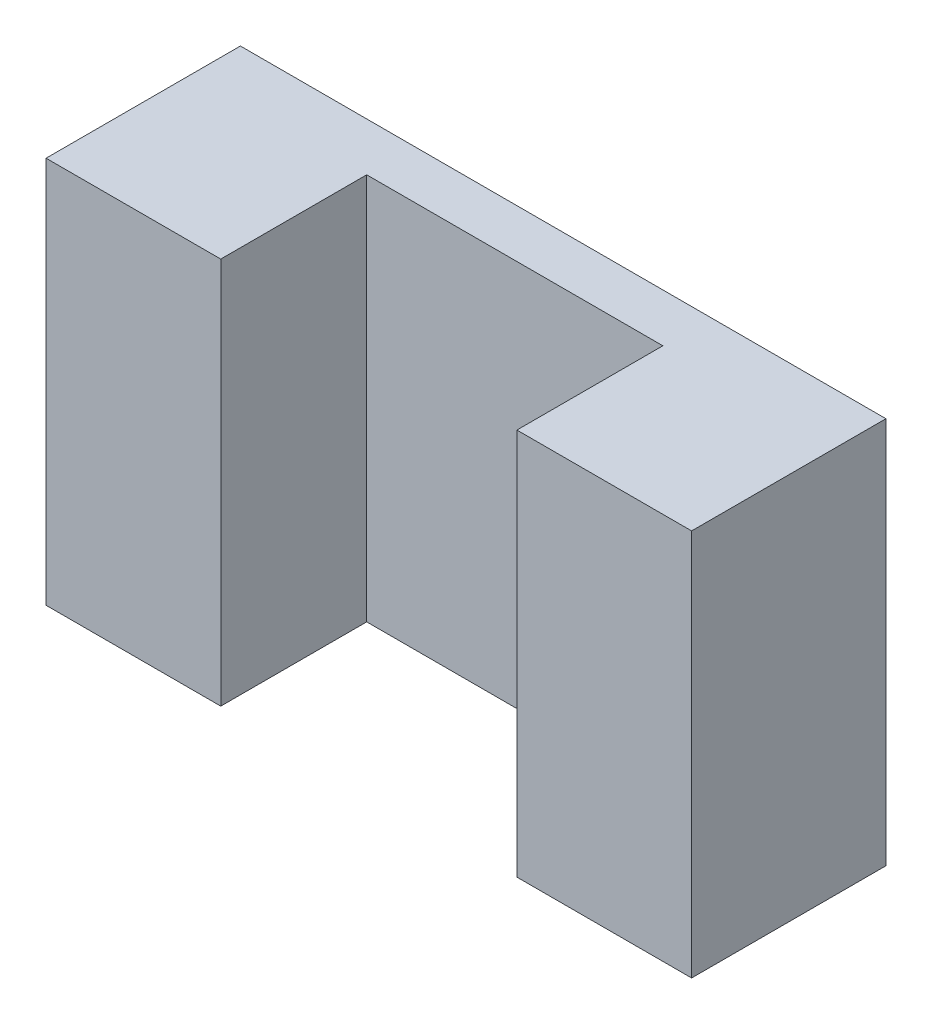
ISO-10303-21;
HEADER;
FILE_DESCRIPTION(('STEP AP214'),'2;1');
FILE_NAME('part.step','',(''),(''),'','','');
FILE_SCHEMA(('AUTOMOTIVE_DESIGN { 1 0 10303 214 1 1 1 1 }'));
ENDSEC;
DATA;
#1=APPLICATION_CONTEXT('core data for automotive mechanical design processes');
#2=APPLICATION_PROTOCOL_DEFINITION('international standard','automotive_design',2000,#1);
#3=PRODUCT_CONTEXT('',#1,'mechanical');
#4=PRODUCT('Part','Part','',(#3));
#5=PRODUCT_RELATED_PRODUCT_CATEGORY('part','',(#4));
#6=PRODUCT_DEFINITION_FORMATION('','',#4);
#7=PRODUCT_DEFINITION_CONTEXT('part definition',#1,'design');
#8=PRODUCT_DEFINITION('design','',#6,#7);
#9=PRODUCT_DEFINITION_SHAPE('','',#8);
#10=(LENGTH_UNIT() NAMED_UNIT(*) SI_UNIT(.MILLI.,.METRE.));
#11=(NAMED_UNIT(*) PLANE_ANGLE_UNIT() SI_UNIT($,.RADIAN.));
#12=(NAMED_UNIT(*) SI_UNIT($,.STERADIAN.) SOLID_ANGLE_UNIT());
#13=UNCERTAINTY_MEASURE_WITH_UNIT(LENGTH_MEASURE(1.E-05),#10,'distance_accuracy_value','');
#14=(GEOMETRIC_REPRESENTATION_CONTEXT(3) GLOBAL_UNCERTAINTY_ASSIGNED_CONTEXT((#13)) GLOBAL_UNIT_ASSIGNED_CONTEXT((#10,
#11,#12)) REPRESENTATION_CONTEXT('',''));
#15=CARTESIAN_POINT('',(0.,0.,0.));
#16=DIRECTION('',(0.,0.,1.));
#17=DIRECTION('',(1.,0.,0.));
#18=AXIS2_PLACEMENT_3D('',#15,#16,#17);
#19=CARTESIAN_POINT('',(0.,0.,20.));
#20=DIRECTION('',(0.,0.,-1.));
#21=DIRECTION('',(-1.,0.,0.));
#22=AXIS2_PLACEMENT_3D('',#19,#20,#21);
#23=PLANE('',#22);
#24=DIRECTION('',(1.,0.,0.));
#25=VECTOR('',#24,1.);
#26=CARTESIAN_POINT('',(33.218726945,-19.925,20.));
#27=LINE('',#26,#25);
#28=CARTESIAN_POINT('',(-33.218726945,-19.925,20.));
#29=VERTEX_POINT('',#28);
#30=CARTESIAN_POINT('',(-15.24,-19.925,20.));
#31=VERTEX_POINT('',#30);
#32=EDGE_CURVE('E85',#29,#31,#27,.T.);
#33=ORIENTED_EDGE('',*,*,#32,.T.);
#34=DIRECTION('',(0.,-1.,0.));
#35=VECTOR('',#34,1.);
#36=CARTESIAN_POINT('',(-15.24,19.925,20.));
#37=LINE('',#36,#35);
#38=CARTESIAN_POINT('',(-15.24,19.925,20.));
#39=VERTEX_POINT('',#38);
#40=EDGE_CURVE('E111',#39,#31,#37,.T.);
#41=ORIENTED_EDGE('',*,*,#40,.F.);
#42=DIRECTION('',(-1.,0.,0.));
#43=VECTOR('',#42,1.);
#44=CARTESIAN_POINT('',(33.218726945,19.925,20.));
#45=LINE('',#44,#43);
#46=CARTESIAN_POINT('',(-33.218726945,19.925,20.));
#47=VERTEX_POINT('',#46);
#48=EDGE_CURVE('E56',#39,#47,#45,.T.);
#49=ORIENTED_EDGE('',*,*,#48,.T.);
#50=DIRECTION('',(0.,-1.,0.));
#51=VECTOR('',#50,1.);
#52=CARTESIAN_POINT('',(-33.218726945,19.925,20.));
#53=LINE('',#52,#51);
#54=EDGE_CURVE('E140',#47,#29,#53,.T.);
#55=ORIENTED_EDGE('',*,*,#54,.T.);
#56=EDGE_LOOP('',(#33,#41,#49,#55));
#57=FACE_BOUND('',#56,.T.);
#58=ADVANCED_FACE('F32',(#57),#23,.F.);
#59=CARTESIAN_POINT('',(-33.218726945,19.925,20.));
#60=DIRECTION('',(1.,0.,0.));
#61=DIRECTION('',(0.,1.,0.));
#62=AXIS2_PLACEMENT_3D('',#59,#60,#61);
#63=PLANE('',#62);
#64=DIRECTION('',(0.,-1.,0.));
#65=VECTOR('',#64,1.);
#66=CARTESIAN_POINT('',(-33.218726945,19.925,0.));
#67=LINE('',#66,#65);
#68=CARTESIAN_POINT('',(-33.218726945,19.925,0.));
#69=VERTEX_POINT('',#68);
#70=CARTESIAN_POINT('',(-33.218726945,-19.925,0.));
#71=VERTEX_POINT('',#70);
#72=EDGE_CURVE('E135',#69,#71,#67,.T.);
#73=ORIENTED_EDGE('',*,*,#72,.T.);
#74=DIRECTION('',(0.,0.,-1.));
#75=VECTOR('',#74,1.);
#76=CARTESIAN_POINT('',(-33.218726945,-19.925,20.));
#77=LINE('',#76,#75);
#78=EDGE_CURVE('E11',#29,#71,#77,.T.);
#79=ORIENTED_EDGE('',*,*,#78,.F.);
#80=ORIENTED_EDGE('',*,*,#54,.F.);
#81=DIRECTION('',(0.,0.,-1.));
#82=VECTOR('',#81,1.);
#83=CARTESIAN_POINT('',(-33.218726945,19.925,20.));
#84=LINE('',#83,#82);
#85=EDGE_CURVE('E149',#47,#69,#84,.T.);
#86=ORIENTED_EDGE('',*,*,#85,.T.);
#87=EDGE_LOOP('',(#73,#79,#80,#86));
#88=FACE_BOUND('',#87,.T.);
#89=ADVANCED_FACE('F34',(#88),#63,.F.);
#90=CARTESIAN_POINT('',(33.218726945,-19.925,20.));
#91=DIRECTION('',(0.,1.,0.));
#92=DIRECTION('',(-1.,0.,0.));
#93=AXIS2_PLACEMENT_3D('',#90,#91,#92);
#94=PLANE('',#93);
#95=DIRECTION('',(1.,0.,0.));
#96=VECTOR('',#95,1.);
#97=CARTESIAN_POINT('',(15.24,-19.925,4.98));
#98=LINE('',#97,#96);
#99=CARTESIAN_POINT('',(-15.24,-19.925,4.98));
#100=VERTEX_POINT('',#99);
#101=CARTESIAN_POINT('',(15.24,-19.925,4.98));
#102=VERTEX_POINT('',#101);
#103=EDGE_CURVE('E119',#100,#102,#98,.T.);
#104=ORIENTED_EDGE('',*,*,#103,.F.);
#105=DIRECTION('',(0.,0.,1.));
#106=VECTOR('',#105,1.);
#107=CARTESIAN_POINT('',(-15.24,-19.925,4.98));
#108=LINE('',#107,#106);
#109=EDGE_CURVE('E106',#100,#31,#108,.T.);
#110=ORIENTED_EDGE('',*,*,#109,.T.);
#111=ORIENTED_EDGE('',*,*,#32,.F.);
#112=ORIENTED_EDGE('',*,*,#78,.T.);
#113=DIRECTION('',(1.,0.,0.));
#114=VECTOR('',#113,1.);
#115=CARTESIAN_POINT('',(33.218726945,-19.925,0.));
#116=LINE('',#115,#114);
#117=CARTESIAN_POINT('',(33.218726945,-19.925,0.));
#118=VERTEX_POINT('',#117);
#119=EDGE_CURVE('E152',#71,#118,#116,.T.);
#120=ORIENTED_EDGE('',*,*,#119,.T.);
#121=DIRECTION('',(0.,0.,-1.));
#122=VECTOR('',#121,1.);
#123=CARTESIAN_POINT('',(33.218726945,-19.925,20.));
#124=LINE('',#123,#122);
#125=CARTESIAN_POINT('',(33.218726945,-19.925,20.));
#126=VERTEX_POINT('',#125);
#127=EDGE_CURVE('E40',#126,#118,#124,.T.);
#128=ORIENTED_EDGE('',*,*,#127,.F.);
#129=CARTESIAN_POINT('',(15.24,-19.925,20.));
#130=VERTEX_POINT('',#129);
#131=EDGE_CURVE('E142',#130,#126,#27,.T.);
#132=ORIENTED_EDGE('',*,*,#131,.F.);
#133=DIRECTION('',(0.,0.,1.));
#134=VECTOR('',#133,1.);
#135=CARTESIAN_POINT('',(15.24,-19.925,4.98));
#136=LINE('',#135,#134);
#137=EDGE_CURVE('E47',#102,#130,#136,.T.);
#138=ORIENTED_EDGE('',*,*,#137,.F.);
#139=EDGE_LOOP('',(#104,#110,#111,#112,#120,#128,#132,#138));
#140=FACE_BOUND('',#139,.T.);
#141=ADVANCED_FACE('F124',(#140),#94,.F.);
#142=CARTESIAN_POINT('',(33.218726945,19.925,20.));
#143=DIRECTION('',(-1.,0.,0.));
#144=DIRECTION('',(0.,-1.,0.));
#145=AXIS2_PLACEMENT_3D('',#142,#143,#144);
#146=PLANE('',#145);
#147=DIRECTION('',(0.,1.,0.));
#148=VECTOR('',#147,1.);
#149=CARTESIAN_POINT('',(33.218726945,19.925,0.));
#150=LINE('',#149,#148);
#151=CARTESIAN_POINT('',(33.218726945,19.925,0.));
#152=VERTEX_POINT('',#151);
#153=EDGE_CURVE('E154',#118,#152,#150,.T.);
#154=ORIENTED_EDGE('',*,*,#153,.T.);
#155=DIRECTION('',(0.,0.,-1.));
#156=VECTOR('',#155,1.);
#157=CARTESIAN_POINT('',(33.218726945,19.925,20.));
#158=LINE('',#157,#156);
#159=CARTESIAN_POINT('',(33.218726945,19.925,20.));
#160=VERTEX_POINT('',#159);
#161=EDGE_CURVE('E158',#160,#152,#158,.T.);
#162=ORIENTED_EDGE('',*,*,#161,.F.);
#163=DIRECTION('',(0.,1.,0.));
#164=VECTOR('',#163,1.);
#165=CARTESIAN_POINT('',(33.218726945,19.925,20.));
#166=LINE('',#165,#164);
#167=EDGE_CURVE('E144',#126,#160,#166,.T.);
#168=ORIENTED_EDGE('',*,*,#167,.F.);
#169=ORIENTED_EDGE('',*,*,#127,.T.);
#170=EDGE_LOOP('',(#154,#162,#168,#169));
#171=FACE_BOUND('',#170,.T.);
#172=ADVANCED_FACE('F164',(#171),#146,.F.);
#173=CARTESIAN_POINT('',(33.218726945,19.925,20.));
#174=DIRECTION('',(0.,-1.,0.));
#175=DIRECTION('',(1.,0.,0.));
#176=AXIS2_PLACEMENT_3D('',#173,#174,#175);
#177=PLANE('',#176);
#178=ORIENTED_EDGE('',*,*,#48,.F.);
#179=DIRECTION('',(0.,0.,1.));
#180=VECTOR('',#179,1.);
#181=CARTESIAN_POINT('',(-15.24,19.925,4.98));
#182=LINE('',#181,#180);
#183=CARTESIAN_POINT('',(-15.24,19.925,4.98));
#184=VERTEX_POINT('',#183);
#185=EDGE_CURVE('E133',#184,#39,#182,.T.);
#186=ORIENTED_EDGE('',*,*,#185,.F.);
#187=DIRECTION('',(-1.,0.,0.));
#188=VECTOR('',#187,1.);
#189=CARTESIAN_POINT('',(15.24,19.925,4.98));
#190=LINE('',#189,#188);
#191=CARTESIAN_POINT('',(15.24,19.925,4.98));
#192=VERTEX_POINT('',#191);
#193=EDGE_CURVE('E113',#192,#184,#190,.T.);
#194=ORIENTED_EDGE('',*,*,#193,.F.);
#195=DIRECTION('',(0.,0.,1.));
#196=VECTOR('',#195,1.);
#197=CARTESIAN_POINT('',(15.24,19.925,4.98));
#198=LINE('',#197,#196);
#199=CARTESIAN_POINT('',(15.24,19.925,20.));
#200=VERTEX_POINT('',#199);
#201=EDGE_CURVE('E136',#192,#200,#198,.T.);
#202=ORIENTED_EDGE('',*,*,#201,.T.);
#203=EDGE_CURVE('E146',#160,#200,#45,.T.);
#204=ORIENTED_EDGE('',*,*,#203,.F.);
#205=ORIENTED_EDGE('',*,*,#161,.T.);
#206=DIRECTION('',(-1.,0.,0.));
#207=VECTOR('',#206,1.);
#208=CARTESIAN_POINT('',(33.218726945,19.925,0.));
#209=LINE('',#208,#207);
#210=EDGE_CURVE('E78',#152,#69,#209,.T.);
#211=ORIENTED_EDGE('',*,*,#210,.T.);
#212=ORIENTED_EDGE('',*,*,#85,.F.);
#213=EDGE_LOOP('',(#178,#186,#194,#202,#204,#205,#211,#212));
#214=FACE_BOUND('',#213,.T.);
#215=ADVANCED_FACE('F172',(#214),#177,.F.);
#216=ORIENTED_EDGE('',*,*,#203,.T.);
#217=DIRECTION('',(0.,1.,0.));
#218=VECTOR('',#217,1.);
#219=CARTESIAN_POINT('',(15.24,19.925,20.));
#220=LINE('',#219,#218);
#221=EDGE_CURVE('E122',#130,#200,#220,.T.);
#222=ORIENTED_EDGE('',*,*,#221,.F.);
#223=ORIENTED_EDGE('',*,*,#131,.T.);
#224=ORIENTED_EDGE('',*,*,#167,.T.);
#225=EDGE_LOOP('',(#216,#222,#223,#224));
#226=FACE_BOUND('',#225,.T.);
#227=ADVANCED_FACE('F175',(#226),#23,.F.);
#228=CARTESIAN_POINT('',(0.,0.,0.));
#229=DIRECTION('',(0.,0.,-1.));
#230=DIRECTION('',(-1.,0.,0.));
#231=AXIS2_PLACEMENT_3D('',#228,#229,#230);
#232=PLANE('',#231);
#233=ORIENTED_EDGE('',*,*,#72,.F.);
#234=ORIENTED_EDGE('',*,*,#210,.F.);
#235=ORIENTED_EDGE('',*,*,#153,.F.);
#236=ORIENTED_EDGE('',*,*,#119,.F.);
#237=EDGE_LOOP('',(#233,#234,#235,#236));
#238=FACE_BOUND('',#237,.T.);
#239=ADVANCED_FACE('F168',(#238),#232,.T.);
#240=CARTESIAN_POINT('',(-15.24,19.925,4.98));
#241=DIRECTION('',(-1.,0.,0.));
#242=DIRECTION('',(0.,0.,1.));
#243=AXIS2_PLACEMENT_3D('',#240,#241,#242);
#244=PLANE('',#243);
#245=ORIENTED_EDGE('',*,*,#40,.T.);
#246=ORIENTED_EDGE('',*,*,#109,.F.);
#247=DIRECTION('',(0.,-1.,0.));
#248=VECTOR('',#247,1.);
#249=CARTESIAN_POINT('',(-15.24,19.925,4.98));
#250=LINE('',#249,#248);
#251=EDGE_CURVE('E109',#184,#100,#250,.T.);
#252=ORIENTED_EDGE('',*,*,#251,.F.);
#253=ORIENTED_EDGE('',*,*,#185,.T.);
#254=EDGE_LOOP('',(#245,#246,#252,#253));
#255=FACE_BOUND('',#254,.T.);
#256=ADVANCED_FACE('F108',(#255),#244,.F.);
#257=CARTESIAN_POINT('',(15.24,19.925,4.98));
#258=DIRECTION('',(1.,0.,0.));
#259=DIRECTION('',(0.,0.,-1.));
#260=AXIS2_PLACEMENT_3D('',#257,#258,#259);
#261=PLANE('',#260);
#262=ORIENTED_EDGE('',*,*,#221,.T.);
#263=ORIENTED_EDGE('',*,*,#201,.F.);
#264=DIRECTION('',(0.,1.,0.));
#265=VECTOR('',#264,1.);
#266=CARTESIAN_POINT('',(15.24,19.925,4.98));
#267=LINE('',#266,#265);
#268=EDGE_CURVE('E126',#102,#192,#267,.T.);
#269=ORIENTED_EDGE('',*,*,#268,.F.);
#270=ORIENTED_EDGE('',*,*,#137,.T.);
#271=EDGE_LOOP('',(#262,#263,#269,#270));
#272=FACE_BOUND('',#271,.T.);
#273=ADVANCED_FACE('F189',(#272),#261,.F.);
#274=CARTESIAN_POINT('',(0.,0.,4.98));
#275=DIRECTION('',(0.,0.,-1.));
#276=DIRECTION('',(-1.,0.,0.));
#277=AXIS2_PLACEMENT_3D('',#274,#275,#276);
#278=PLANE('',#277);
#279=ORIENTED_EDGE('',*,*,#251,.T.);
#280=ORIENTED_EDGE('',*,*,#103,.T.);
#281=ORIENTED_EDGE('',*,*,#268,.T.);
#282=ORIENTED_EDGE('',*,*,#193,.T.);
#283=EDGE_LOOP('',(#279,#280,#281,#282));
#284=FACE_BOUND('',#283,.T.);
#285=ADVANCED_FACE('F117',(#284),#278,.F.);
#286=CLOSED_SHELL('',(#58,#89,#141,#172,#215,#227,#239,#256,#273,#285));
#287=MANIFOLD_SOLID_BREP('B2',#286);
#288=ADVANCED_BREP_SHAPE_REPRESENTATION('',(#18,#287),#14);
#289=SHAPE_DEFINITION_REPRESENTATION(#9,#288);
ENDSEC;
END-ISO-10303-21;
